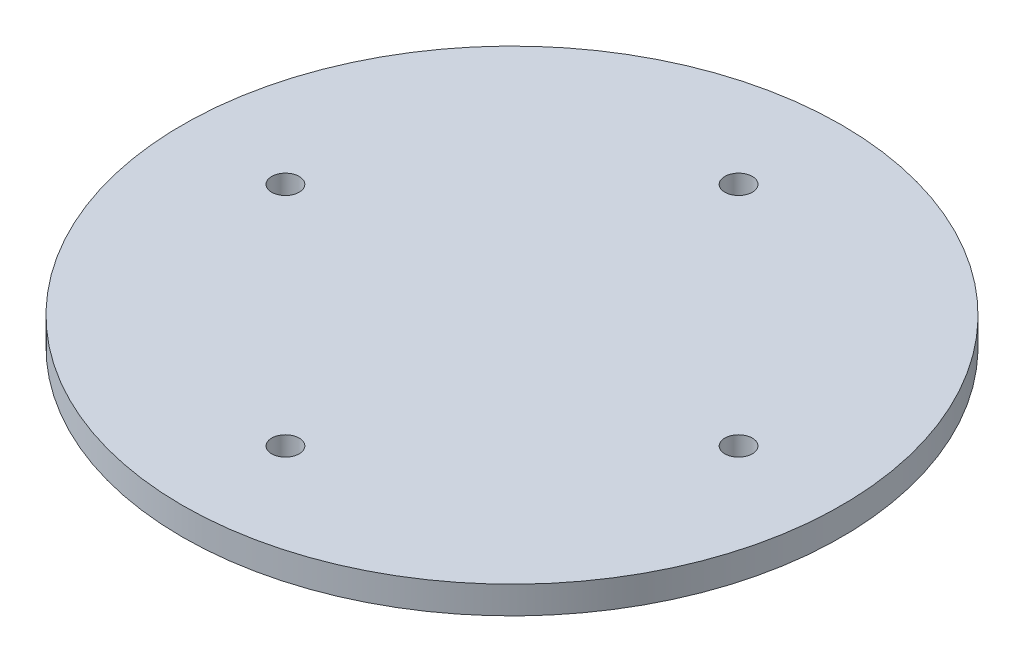
ISO-10303-21;
HEADER;
FILE_DESCRIPTION(('STEP AP214'),'2;1');
FILE_NAME('part.step','',(''),(''),'','','');
FILE_SCHEMA(('AUTOMOTIVE_DESIGN { 1 0 10303 214 1 1 1 1 }'));
ENDSEC;
DATA;
#1=APPLICATION_CONTEXT('core data for automotive mechanical design processes');
#2=APPLICATION_PROTOCOL_DEFINITION('international standard','automotive_design',2000,#1);
#3=PRODUCT_CONTEXT('',#1,'mechanical');
#4=PRODUCT('Part','Part','',(#3));
#5=PRODUCT_RELATED_PRODUCT_CATEGORY('part','',(#4));
#6=PRODUCT_DEFINITION_FORMATION('','',#4);
#7=PRODUCT_DEFINITION_CONTEXT('part definition',#1,'design');
#8=PRODUCT_DEFINITION('design','',#6,#7);
#9=PRODUCT_DEFINITION_SHAPE('','',#8);
#10=(LENGTH_UNIT() NAMED_UNIT(*) SI_UNIT(.MILLI.,.METRE.));
#11=(NAMED_UNIT(*) PLANE_ANGLE_UNIT() SI_UNIT($,.RADIAN.));
#12=(NAMED_UNIT(*) SI_UNIT($,.STERADIAN.) SOLID_ANGLE_UNIT());
#13=UNCERTAINTY_MEASURE_WITH_UNIT(LENGTH_MEASURE(1.E-05),#10,'distance_accuracy_value','');
#14=(GEOMETRIC_REPRESENTATION_CONTEXT(3) GLOBAL_UNCERTAINTY_ASSIGNED_CONTEXT((#13)) GLOBAL_UNIT_ASSIGNED_CONTEXT((#10,
#11,#12)) REPRESENTATION_CONTEXT('',''));
#15=CARTESIAN_POINT('',(0.,0.,0.));
#16=DIRECTION('',(0.,0.,1.));
#17=DIRECTION('',(1.,0.,0.));
#18=AXIS2_PLACEMENT_3D('',#15,#16,#17);
#19=CARTESIAN_POINT('',(0.,5.,0.));
#20=DIRECTION('',(0.,1.,0.));
#21=DIRECTION('',(0.,0.,1.));
#22=AXIS2_PLACEMENT_3D('',#19,#20,#21);
#23=PLANE('',#22);
#24=CARTESIAN_POINT('',(2.33468769191537E-12,5.,41.25));
#25=DIRECTION('',(0.,1.,0.));
#26=DIRECTION('',(0.,0.,1.));
#27=AXIS2_PLACEMENT_3D('',#24,#25,#26);
#28=CIRCLE('',#27,2.50000000000251);
#29=CARTESIAN_POINT('',(2.33468769191537E-12,5.,43.7500000000025));
#30=VERTEX_POINT('',#29);
#31=EDGE_CURVE('E65',#30,#30,#28,.T.);
#32=ORIENTED_EDGE('',*,*,#31,.F.);
#33=EDGE_LOOP('',(#32));
#34=FACE_BOUND('',#33,.T.);
#35=CARTESIAN_POINT('',(0.,5.,-41.25));
#36=DIRECTION('',(0.,1.,0.));
#37=DIRECTION('',(0.,0.,1.));
#38=AXIS2_PLACEMENT_3D('',#35,#36,#37);
#39=CIRCLE('',#38,2.5);
#40=CARTESIAN_POINT('',(0.,5.,-38.75));
#41=VERTEX_POINT('',#40);
#42=EDGE_CURVE('E47',#41,#41,#39,.T.);
#43=ORIENTED_EDGE('',*,*,#42,.F.);
#44=EDGE_LOOP('',(#43));
#45=FACE_BOUND('',#44,.T.);
#46=CARTESIAN_POINT('',(0.,5.,0.));
#47=DIRECTION('',(0.,1.,0.));
#48=DIRECTION('',(0.,0.,1.));
#49=AXIS2_PLACEMENT_3D('',#46,#47,#48);
#50=CIRCLE('',#49,60.);
#51=CARTESIAN_POINT('',(0.,5.,60.));
#52=VERTEX_POINT('',#51);
#53=EDGE_CURVE('E11',#52,#52,#50,.T.);
#54=ORIENTED_EDGE('',*,*,#53,.T.);
#55=EDGE_LOOP('',(#54));
#56=FACE_BOUND('',#55,.T.);
#57=CARTESIAN_POINT('',(41.2500000000012,5.,-1.16734384595768E-12));
#58=DIRECTION('',(0.,1.,0.));
#59=DIRECTION('',(0.,0.,1.));
#60=AXIS2_PLACEMENT_3D('',#57,#58,#59);
#61=CIRCLE('',#60,2.50000000000092);
#62=CARTESIAN_POINT('',(41.2500000000012,5.,2.49999999999975));
#63=VERTEX_POINT('',#62);
#64=EDGE_CURVE('E56',#63,#63,#61,.T.);
#65=ORIENTED_EDGE('',*,*,#64,.F.);
#66=EDGE_LOOP('',(#65));
#67=FACE_BOUND('',#66,.T.);
#68=CARTESIAN_POINT('',(-41.2499999999988,5.,1.17239551400417E-12));
#69=DIRECTION('',(0.,1.,0.));
#70=DIRECTION('',(0.,0.,1.));
#71=AXIS2_PLACEMENT_3D('',#68,#69,#70);
#72=CIRCLE('',#71,2.50000000000187);
#73=CARTESIAN_POINT('',(-41.2499999999988,5.,2.50000000000305));
#74=VERTEX_POINT('',#73);
#75=EDGE_CURVE('E104',#74,#74,#72,.T.);
#76=ORIENTED_EDGE('',*,*,#75,.F.);
#77=EDGE_LOOP('',(#76));
#78=FACE_BOUND('',#77,.T.);
#79=ADVANCED_FACE('F33',(#34,#45,#56,#67,#78),#23,.T.);
#80=CARTESIAN_POINT('',(0.,0.,0.));
#81=DIRECTION('',(0.,1.,0.));
#82=DIRECTION('',(0.,0.,1.));
#83=AXIS2_PLACEMENT_3D('',#80,#81,#82);
#84=PLANE('',#83);
#85=CARTESIAN_POINT('',(0.,0.,0.));
#86=DIRECTION('',(0.,1.,0.));
#87=DIRECTION('',(0.,0.,1.));
#88=AXIS2_PLACEMENT_3D('',#85,#86,#87);
#89=CIRCLE('',#88,60.);
#90=CARTESIAN_POINT('',(0.,0.,60.));
#91=VERTEX_POINT('',#90);
#92=EDGE_CURVE('E37',#91,#91,#89,.T.);
#93=ORIENTED_EDGE('',*,*,#92,.F.);
#94=EDGE_LOOP('',(#93));
#95=FACE_BOUND('',#94,.T.);
#96=CARTESIAN_POINT('',(0.,0.,-41.25));
#97=DIRECTION('',(0.,1.,0.));
#98=DIRECTION('',(0.,0.,1.));
#99=AXIS2_PLACEMENT_3D('',#96,#97,#98);
#100=CIRCLE('',#99,2.5);
#101=CARTESIAN_POINT('',(0.,0.,-38.75));
#102=VERTEX_POINT('',#101);
#103=EDGE_CURVE('E50',#102,#102,#100,.T.);
#104=ORIENTED_EDGE('',*,*,#103,.T.);
#105=EDGE_LOOP('',(#104));
#106=FACE_BOUND('',#105,.T.);
#107=CARTESIAN_POINT('',(41.2500000000012,0.,-1.16734384595768E-12));
#108=DIRECTION('',(0.,1.,0.));
#109=DIRECTION('',(0.,0.,1.));
#110=AXIS2_PLACEMENT_3D('',#107,#108,#109);
#111=CIRCLE('',#110,2.50000000000092);
#112=CARTESIAN_POINT('',(41.2500000000012,0.,2.49999999999975));
#113=VERTEX_POINT('',#112);
#114=EDGE_CURVE('E61',#113,#113,#111,.T.);
#115=ORIENTED_EDGE('',*,*,#114,.T.);
#116=EDGE_LOOP('',(#115));
#117=FACE_BOUND('',#116,.T.);
#118=CARTESIAN_POINT('',(2.33468769191537E-12,0.,41.25));
#119=DIRECTION('',(0.,1.,0.));
#120=DIRECTION('',(0.,0.,1.));
#121=AXIS2_PLACEMENT_3D('',#118,#119,#120);
#122=CIRCLE('',#121,2.50000000000251);
#123=CARTESIAN_POINT('',(2.33468769191537E-12,0.,43.7500000000025));
#124=VERTEX_POINT('',#123);
#125=EDGE_CURVE('E62',#124,#124,#122,.T.);
#126=ORIENTED_EDGE('',*,*,#125,.T.);
#127=EDGE_LOOP('',(#126));
#128=FACE_BOUND('',#127,.T.);
#129=CARTESIAN_POINT('',(-41.2499999999988,0.,1.17239551400417E-12));
#130=DIRECTION('',(0.,1.,0.));
#131=DIRECTION('',(0.,0.,1.));
#132=AXIS2_PLACEMENT_3D('',#129,#130,#131);
#133=CIRCLE('',#132,2.50000000000187);
#134=CARTESIAN_POINT('',(-41.2499999999988,0.,2.50000000000305));
#135=VERTEX_POINT('',#134);
#136=EDGE_CURVE('E107',#135,#135,#133,.T.);
#137=ORIENTED_EDGE('',*,*,#136,.T.);
#138=EDGE_LOOP('',(#137));
#139=FACE_BOUND('',#138,.T.);
#140=ADVANCED_FACE('F74',(#95,#106,#117,#128,#139),#84,.F.);
#141=CARTESIAN_POINT('',(0.,5.,0.));
#142=DIRECTION('',(0.,-1.,0.));
#143=DIRECTION('',(0.,0.,-1.));
#144=AXIS2_PLACEMENT_3D('',#141,#142,#143);
#145=CYLINDRICAL_SURFACE('',#144,60.);
#146=ORIENTED_EDGE('',*,*,#53,.F.);
#147=EDGE_LOOP('',(#146));
#148=FACE_BOUND('',#147,.T.);
#149=ORIENTED_EDGE('',*,*,#92,.T.);
#150=EDGE_LOOP('',(#149));
#151=FACE_BOUND('',#150,.T.);
#152=ADVANCED_FACE('F35',(#148,#151),#145,.T.);
#153=CARTESIAN_POINT('',(0.,5.,-41.25));
#154=DIRECTION('',(0.,-1.,0.));
#155=DIRECTION('',(0.,0.,-1.));
#156=AXIS2_PLACEMENT_3D('',#153,#154,#155);
#157=CYLINDRICAL_SURFACE('',#156,2.5);
#158=ORIENTED_EDGE('',*,*,#42,.T.);
#159=EDGE_LOOP('',(#158));
#160=FACE_BOUND('',#159,.T.);
#161=ORIENTED_EDGE('',*,*,#103,.F.);
#162=EDGE_LOOP('',(#161));
#163=FACE_BOUND('',#162,.T.);
#164=ADVANCED_FACE('F77',(#160,#163),#157,.F.);
#165=CARTESIAN_POINT('',(41.2500000000012,5.,-1.16734384595768E-12));
#166=DIRECTION('',(0.,-1.,0.));
#167=DIRECTION('',(0.,0.,-1.));
#168=AXIS2_PLACEMENT_3D('',#165,#166,#167);
#169=CYLINDRICAL_SURFACE('',#168,2.50000000000092);
#170=ORIENTED_EDGE('',*,*,#64,.T.);
#171=EDGE_LOOP('',(#170));
#172=FACE_BOUND('',#171,.T.);
#173=ORIENTED_EDGE('',*,*,#114,.F.);
#174=EDGE_LOOP('',(#173));
#175=FACE_BOUND('',#174,.T.);
#176=ADVANCED_FACE('F79',(#172,#175),#169,.F.);
#177=CARTESIAN_POINT('',(2.33468769191537E-12,5.,41.25));
#178=DIRECTION('',(0.,-1.,0.));
#179=DIRECTION('',(0.,0.,-1.));
#180=AXIS2_PLACEMENT_3D('',#177,#178,#179);
#181=CYLINDRICAL_SURFACE('',#180,2.50000000000251);
#182=ORIENTED_EDGE('',*,*,#31,.T.);
#183=EDGE_LOOP('',(#182));
#184=FACE_BOUND('',#183,.T.);
#185=ORIENTED_EDGE('',*,*,#125,.F.);
#186=EDGE_LOOP('',(#185));
#187=FACE_BOUND('',#186,.T.);
#188=ADVANCED_FACE('F85',(#184,#187),#181,.F.);
#189=CARTESIAN_POINT('',(-41.2499999999988,5.,1.17239551400417E-12));
#190=DIRECTION('',(0.,-1.,0.));
#191=DIRECTION('',(0.,0.,-1.));
#192=AXIS2_PLACEMENT_3D('',#189,#190,#191);
#193=CYLINDRICAL_SURFACE('',#192,2.50000000000187);
#194=ORIENTED_EDGE('',*,*,#75,.T.);
#195=EDGE_LOOP('',(#194));
#196=FACE_BOUND('',#195,.T.);
#197=ORIENTED_EDGE('',*,*,#136,.F.);
#198=EDGE_LOOP('',(#197));
#199=FACE_BOUND('',#198,.T.);
#200=ADVANCED_FACE('F116',(#196,#199),#193,.F.);
#201=CLOSED_SHELL('',(#79,#140,#152,#164,#176,#188,#200));
#202=MANIFOLD_SOLID_BREP('B2',#201);
#203=ADVANCED_BREP_SHAPE_REPRESENTATION('',(#18,#202),#14);
#204=SHAPE_DEFINITION_REPRESENTATION(#9,#203);
ENDSEC;
END-ISO-10303-21;
